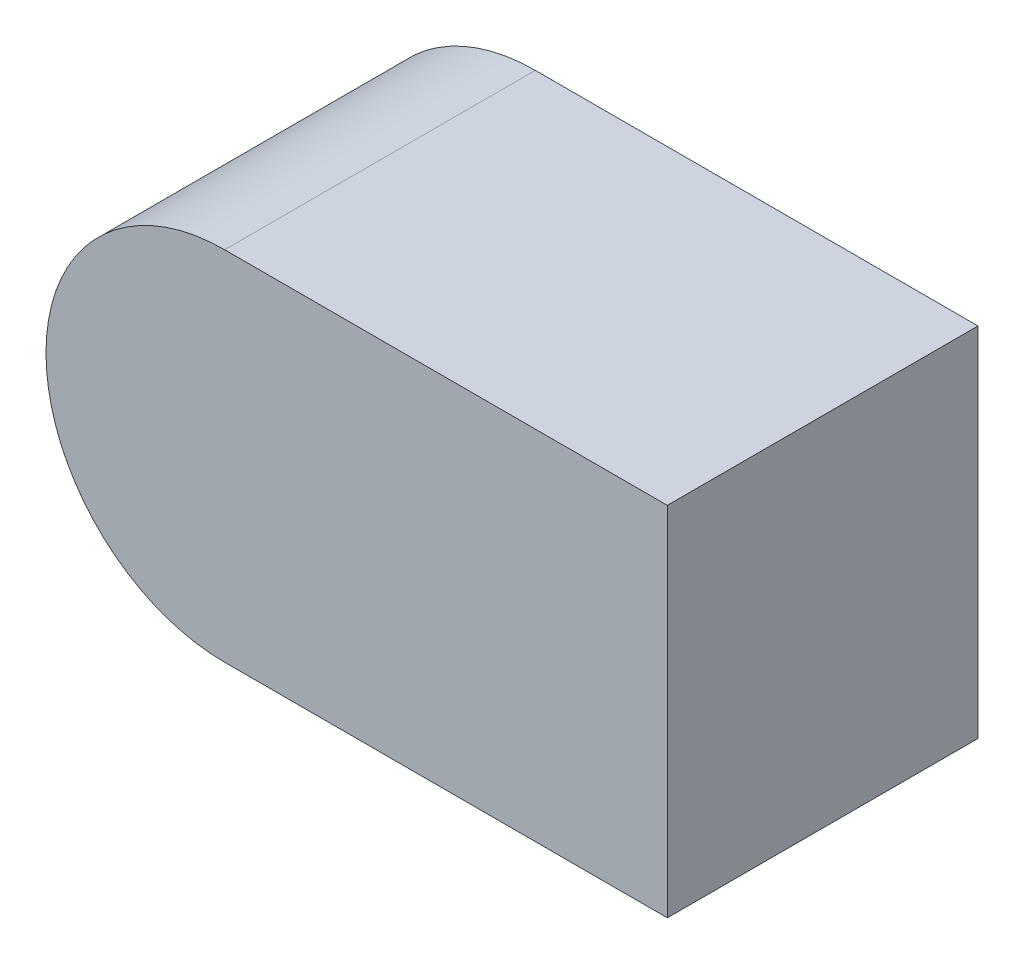
ISO-10303-21;
HEADER;
FILE_DESCRIPTION(('STEP AP214'),'2;1');
FILE_NAME('part.step','',(''),(''),'','','');
FILE_SCHEMA(('AUTOMOTIVE_DESIGN { 1 0 10303 214 1 1 1 1 }'));
ENDSEC;
DATA;
#1=APPLICATION_CONTEXT('core data for automotive mechanical design processes');
#2=APPLICATION_PROTOCOL_DEFINITION('international standard','automotive_design',2000,#1);
#3=PRODUCT_CONTEXT('',#1,'mechanical');
#4=PRODUCT('Part','Part','',(#3));
#5=PRODUCT_RELATED_PRODUCT_CATEGORY('part','',(#4));
#6=PRODUCT_DEFINITION_FORMATION('','',#4);
#7=PRODUCT_DEFINITION_CONTEXT('part definition',#1,'design');
#8=PRODUCT_DEFINITION('design','',#6,#7);
#9=PRODUCT_DEFINITION_SHAPE('','',#8);
#10=(LENGTH_UNIT() NAMED_UNIT(*) SI_UNIT(.MILLI.,.METRE.));
#11=(NAMED_UNIT(*) PLANE_ANGLE_UNIT() SI_UNIT($,.RADIAN.));
#12=(NAMED_UNIT(*) SI_UNIT($,.STERADIAN.) SOLID_ANGLE_UNIT());
#13=UNCERTAINTY_MEASURE_WITH_UNIT(LENGTH_MEASURE(1.E-05),#10,'distance_accuracy_value','');
#14=(GEOMETRIC_REPRESENTATION_CONTEXT(3) GLOBAL_UNCERTAINTY_ASSIGNED_CONTEXT((#13)) GLOBAL_UNIT_ASSIGNED_CONTEXT((#10,
#11,#12)) REPRESENTATION_CONTEXT('',''));
#15=CARTESIAN_POINT('',(0.,0.,0.));
#16=DIRECTION('',(0.,0.,1.));
#17=DIRECTION('',(1.,0.,0.));
#18=AXIS2_PLACEMENT_3D('',#15,#16,#17);
#19=CARTESIAN_POINT('',(2.8335265642716,-0.25,0.));
#20=DIRECTION('',(0.,0.,1.));
#21=DIRECTION('',(-1.,0.,0.));
#22=AXIS2_PLACEMENT_3D('',#19,#20,#21);
#23=PLANE('',#22);
#24=DIRECTION('',(0.,1.,0.));
#25=VECTOR('',#24,1.);
#26=CARTESIAN_POINT('',(3.,-0.365,0.));
#27=LINE('',#26,#25);
#28=CARTESIAN_POINT('',(3.,-0.365,0.));
#29=VERTEX_POINT('',#28);
#30=CARTESIAN_POINT('',(3.,-0.135,0.));
#31=VERTEX_POINT('',#30);
#32=EDGE_CURVE('E11',#29,#31,#27,.T.);
#33=ORIENTED_EDGE('',*,*,#32,.F.);
#34=DIRECTION('',(1.,0.,0.));
#35=VECTOR('',#34,1.);
#36=CARTESIAN_POINT('',(2.715,-0.365,0.));
#37=LINE('',#36,#35);
#38=CARTESIAN_POINT('',(2.715,-0.365,0.));
#39=VERTEX_POINT('',#38);
#40=EDGE_CURVE('E24',#39,#29,#37,.T.);
#41=ORIENTED_EDGE('',*,*,#40,.F.);
#42=CARTESIAN_POINT('',(2.715,-0.25,0.));
#43=DIRECTION('',(0.,0.,1.));
#44=DIRECTION('',(0.,1.,0.));
#45=AXIS2_PLACEMENT_3D('',#42,#43,#44);
#46=CIRCLE('',#45,0.115);
#47=CARTESIAN_POINT('',(2.715,-0.135000000000001,0.));
#48=VERTEX_POINT('',#47);
#49=EDGE_CURVE('E85',#48,#39,#46,.T.);
#50=ORIENTED_EDGE('',*,*,#49,.F.);
#51=DIRECTION('',(-1.,0.,0.));
#52=VECTOR('',#51,1.);
#53=CARTESIAN_POINT('',(3.,-0.135,0.));
#54=LINE('',#53,#52);
#55=EDGE_CURVE('E82',#31,#48,#54,.T.);
#56=ORIENTED_EDGE('',*,*,#55,.F.);
#57=EDGE_LOOP('',(#33,#41,#50,#56));
#58=FACE_BOUND('',#57,.T.);
#59=ADVANCED_FACE('F17',(#58),#23,.F.);
#60=CARTESIAN_POINT('',(3.,-0.135,0.));
#61=DIRECTION('',(0.,1.,0.));
#62=DIRECTION('',(-1.,0.,0.));
#63=AXIS2_PLACEMENT_3D('',#60,#61,#62);
#64=PLANE('',#63);
#65=ORIENTED_EDGE('',*,*,#55,.T.);
#66=DIRECTION('',(0.,0.,1.));
#67=VECTOR('',#66,1.);
#68=CARTESIAN_POINT('',(2.715,-0.135000000000001,0.));
#69=LINE('',#68,#67);
#70=CARTESIAN_POINT('',(2.715,-0.135000000000001,0.2));
#71=VERTEX_POINT('',#70);
#72=EDGE_CURVE('E80',#48,#71,#69,.T.);
#73=ORIENTED_EDGE('',*,*,#72,.T.);
#74=DIRECTION('',(-1.,0.,0.));
#75=VECTOR('',#74,1.);
#76=CARTESIAN_POINT('',(3.,-0.135,0.2));
#77=LINE('',#76,#75);
#78=CARTESIAN_POINT('',(3.,-0.135,0.2));
#79=VERTEX_POINT('',#78);
#80=EDGE_CURVE('E78',#79,#71,#77,.T.);
#81=ORIENTED_EDGE('',*,*,#80,.F.);
#82=DIRECTION('',(0.,0.,-1.));
#83=VECTOR('',#82,1.);
#84=CARTESIAN_POINT('',(3.,-0.135000000000001,0.));
#85=LINE('',#84,#83);
#86=EDGE_CURVE('E71',#79,#31,#85,.T.);
#87=ORIENTED_EDGE('',*,*,#86,.T.);
#88=EDGE_LOOP('',(#65,#73,#81,#87));
#89=FACE_BOUND('',#88,.T.);
#90=ADVANCED_FACE('F91',(#89),#64,.T.);
#91=CARTESIAN_POINT('',(2.715,-0.25,0.));
#92=DIRECTION('',(0.,0.,1.));
#93=DIRECTION('',(0.,1.,0.));
#94=AXIS2_PLACEMENT_3D('',#91,#92,#93);
#95=CYLINDRICAL_SURFACE('',#94,0.115);
#96=ORIENTED_EDGE('',*,*,#49,.T.);
#97=DIRECTION('',(0.,0.,1.));
#98=VECTOR('',#97,1.);
#99=CARTESIAN_POINT('',(2.715,-0.365,0.));
#100=LINE('',#99,#98);
#101=CARTESIAN_POINT('',(2.715,-0.365,0.2));
#102=VERTEX_POINT('',#101);
#103=EDGE_CURVE('E75',#39,#102,#100,.T.);
#104=ORIENTED_EDGE('',*,*,#103,.T.);
#105=CARTESIAN_POINT('',(2.715,-0.25,0.2));
#106=DIRECTION('',(0.,0.,1.));
#107=DIRECTION('',(0.,1.,0.));
#108=AXIS2_PLACEMENT_3D('',#105,#106,#107);
#109=CIRCLE('',#108,0.115);
#110=EDGE_CURVE('E59',#71,#102,#109,.T.);
#111=ORIENTED_EDGE('',*,*,#110,.F.);
#112=ORIENTED_EDGE('',*,*,#72,.F.);
#113=EDGE_LOOP('',(#96,#104,#111,#112));
#114=FACE_BOUND('',#113,.T.);
#115=ADVANCED_FACE('F89',(#114),#95,.T.);
#116=CARTESIAN_POINT('',(2.715,-0.365,0.));
#117=DIRECTION('',(0.,-1.,0.));
#118=DIRECTION('',(1.,0.,0.));
#119=AXIS2_PLACEMENT_3D('',#116,#117,#118);
#120=PLANE('',#119);
#121=ORIENTED_EDGE('',*,*,#40,.T.);
#122=DIRECTION('',(0.,0.,1.));
#123=VECTOR('',#122,1.);
#124=CARTESIAN_POINT('',(3.,-0.365,0.));
#125=LINE('',#124,#123);
#126=CARTESIAN_POINT('',(3.,-0.365,0.2));
#127=VERTEX_POINT('',#126);
#128=EDGE_CURVE('E53',#29,#127,#125,.T.);
#129=ORIENTED_EDGE('',*,*,#128,.T.);
#130=DIRECTION('',(1.,0.,0.));
#131=VECTOR('',#130,1.);
#132=CARTESIAN_POINT('',(2.715,-0.365,0.2));
#133=LINE('',#132,#131);
#134=EDGE_CURVE('E57',#102,#127,#133,.T.);
#135=ORIENTED_EDGE('',*,*,#134,.F.);
#136=ORIENTED_EDGE('',*,*,#103,.F.);
#137=EDGE_LOOP('',(#121,#129,#135,#136));
#138=FACE_BOUND('',#137,.T.);
#139=ADVANCED_FACE('F55',(#138),#120,.T.);
#140=CARTESIAN_POINT('',(3.,-3.,0.));
#141=DIRECTION('',(1.,0.,0.));
#142=DIRECTION('',(0.,1.,0.));
#143=AXIS2_PLACEMENT_3D('',#140,#141,#142);
#144=PLANE('',#143);
#145=ORIENTED_EDGE('',*,*,#86,.F.);
#146=DIRECTION('',(0.,1.,0.));
#147=VECTOR('',#146,1.);
#148=CARTESIAN_POINT('',(3.,-1.625,0.2));
#149=LINE('',#148,#147);
#150=EDGE_CURVE('E66',#127,#79,#149,.T.);
#151=ORIENTED_EDGE('',*,*,#150,.F.);
#152=ORIENTED_EDGE('',*,*,#128,.F.);
#153=ORIENTED_EDGE('',*,*,#32,.T.);
#154=EDGE_LOOP('',(#145,#151,#152,#153));
#155=FACE_BOUND('',#154,.T.);
#156=ADVANCED_FACE('F69',(#155),#144,.T.);
#157=CARTESIAN_POINT('',(2.8335240809167,-0.25,0.2));
#158=DIRECTION('',(0.,0.,1.));
#159=DIRECTION('',(1.,0.,0.));
#160=AXIS2_PLACEMENT_3D('',#157,#158,#159);
#161=PLANE('',#160);
#162=ORIENTED_EDGE('',*,*,#134,.T.);
#163=ORIENTED_EDGE('',*,*,#150,.T.);
#164=ORIENTED_EDGE('',*,*,#80,.T.);
#165=ORIENTED_EDGE('',*,*,#110,.T.);
#166=EDGE_LOOP('',(#162,#163,#164,#165));
#167=FACE_BOUND('',#166,.T.);
#168=ADVANCED_FACE('F64',(#167),#161,.T.);
#169=CLOSED_SHELL('',(#59,#90,#115,#139,#156,#168));
#170=MANIFOLD_SOLID_BREP('B1',#169);
#171=ADVANCED_BREP_SHAPE_REPRESENTATION('',(#18,#170),#14);
#172=SHAPE_DEFINITION_REPRESENTATION(#9,#171);
ENDSEC;
END-ISO-10303-21;
